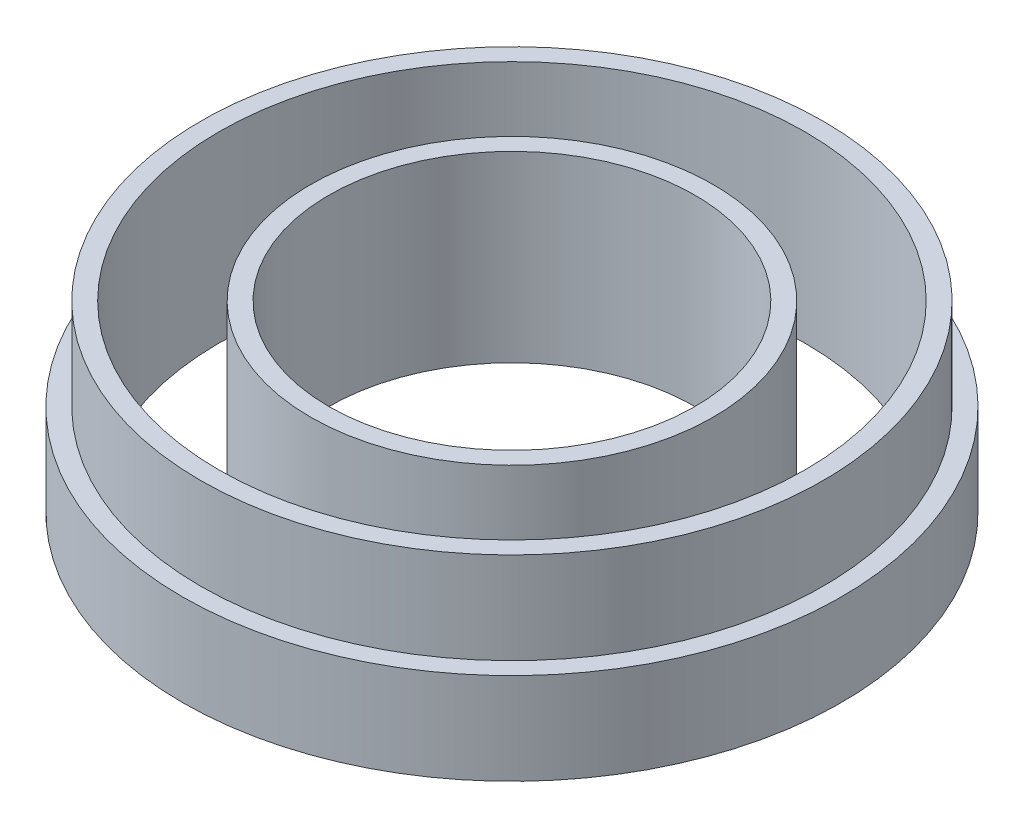
ISO-10303-21;
HEADER;
FILE_DESCRIPTION(('STEP AP214'),'2;1');
FILE_NAME('part.step','',(''),(''),'','','');
FILE_SCHEMA(('AUTOMOTIVE_DESIGN { 1 0 10303 214 1 1 1 1 }'));
ENDSEC;
DATA;
#1=APPLICATION_CONTEXT('core data for automotive mechanical design processes');
#2=APPLICATION_PROTOCOL_DEFINITION('international standard','automotive_design',2000,#1);
#3=PRODUCT_CONTEXT('',#1,'mechanical');
#4=PRODUCT('Part','Part','',(#3));
#5=PRODUCT_RELATED_PRODUCT_CATEGORY('part','',(#4));
#6=PRODUCT_DEFINITION_FORMATION('','',#4);
#7=PRODUCT_DEFINITION_CONTEXT('part definition',#1,'design');
#8=PRODUCT_DEFINITION('design','',#6,#7);
#9=PRODUCT_DEFINITION_SHAPE('','',#8);
#10=(LENGTH_UNIT() NAMED_UNIT(*) SI_UNIT(.MILLI.,.METRE.));
#11=(NAMED_UNIT(*) PLANE_ANGLE_UNIT() SI_UNIT($,.RADIAN.));
#12=(NAMED_UNIT(*) SI_UNIT($,.STERADIAN.) SOLID_ANGLE_UNIT());
#13=UNCERTAINTY_MEASURE_WITH_UNIT(LENGTH_MEASURE(1.E-05),#10,'distance_accuracy_value','');
#14=(GEOMETRIC_REPRESENTATION_CONTEXT(3) GLOBAL_UNCERTAINTY_ASSIGNED_CONTEXT((#13)) GLOBAL_UNIT_ASSIGNED_CONTEXT((#10,
#11,#12)) REPRESENTATION_CONTEXT('',''));
#15=CARTESIAN_POINT('',(0.,0.,0.));
#16=DIRECTION('',(0.,0.,1.));
#17=DIRECTION('',(1.,0.,0.));
#18=AXIS2_PLACEMENT_3D('',#15,#16,#17);
#19=CARTESIAN_POINT('',(0.,5.,0.));
#20=DIRECTION('',(0.,-1.,0.));
#21=DIRECTION('',(0.,0.,-1.));
#22=AXIS2_PLACEMENT_3D('',#19,#20,#21);
#23=CYLINDRICAL_SURFACE('',#22,8.);
#24=CARTESIAN_POINT('',(0.,5.,0.));
#25=DIRECTION('',(0.,1.,0.));
#26=DIRECTION('',(0.,0.,1.));
#27=AXIS2_PLACEMENT_3D('',#24,#25,#26);
#28=CIRCLE('',#27,8.);
#29=CARTESIAN_POINT('',(0.,5.,8.));
#30=VERTEX_POINT('',#29);
#31=EDGE_CURVE('E54',#30,#30,#28,.T.);
#32=ORIENTED_EDGE('',*,*,#31,.T.);
#33=EDGE_LOOP('',(#32));
#34=FACE_BOUND('',#33,.T.);
#35=CARTESIAN_POINT('',(0.,0.,0.));
#36=DIRECTION('',(0.,1.,0.));
#37=DIRECTION('',(0.,0.,1.));
#38=AXIS2_PLACEMENT_3D('',#35,#36,#37);
#39=CIRCLE('',#38,8.);
#40=CARTESIAN_POINT('',(0.,0.,8.));
#41=VERTEX_POINT('',#40);
#42=EDGE_CURVE('E50',#41,#41,#39,.T.);
#43=ORIENTED_EDGE('',*,*,#42,.F.);
#44=EDGE_LOOP('',(#43));
#45=FACE_BOUND('',#44,.T.);
#46=ADVANCED_FACE('F47',(#34,#45),#23,.F.);
#47=CARTESIAN_POINT('',(0.,5.,0.));
#48=DIRECTION('',(0.,-1.,0.));
#49=DIRECTION('',(0.,0.,-1.));
#50=AXIS2_PLACEMENT_3D('',#47,#48,#49);
#51=CYLINDRICAL_SURFACE('',#50,8.5);
#52=CARTESIAN_POINT('',(0.,2.5,0.));
#53=DIRECTION('',(0.,1.,0.));
#54=DIRECTION('',(0.,0.,1.));
#55=AXIS2_PLACEMENT_3D('',#52,#53,#54);
#56=CIRCLE('',#55,8.5);
#57=CARTESIAN_POINT('',(0.,2.5,8.5));
#58=VERTEX_POINT('',#57);
#59=EDGE_CURVE('E64',#58,#58,#56,.T.);
#60=ORIENTED_EDGE('',*,*,#59,.T.);
#61=EDGE_LOOP('',(#60));
#62=FACE_BOUND('',#61,.T.);
#63=CARTESIAN_POINT('',(0.,5.,0.));
#64=DIRECTION('',(0.,1.,0.));
#65=DIRECTION('',(0.,0.,1.));
#66=AXIS2_PLACEMENT_3D('',#63,#64,#65);
#67=CIRCLE('',#66,8.5);
#68=CARTESIAN_POINT('',(0.,5.,8.5));
#69=VERTEX_POINT('',#68);
#70=EDGE_CURVE('E12',#69,#69,#67,.T.);
#71=ORIENTED_EDGE('',*,*,#70,.F.);
#72=EDGE_LOOP('',(#71));
#73=FACE_BOUND('',#72,.T.);
#74=ADVANCED_FACE('F70',(#62,#73),#51,.T.);
#75=CARTESIAN_POINT('',(0.,5.,0.));
#76=DIRECTION('',(0.,1.,0.));
#77=DIRECTION('',(0.,0.,1.));
#78=AXIS2_PLACEMENT_3D('',#75,#76,#77);
#79=PLANE('',#78);
#80=ORIENTED_EDGE('',*,*,#31,.F.);
#81=EDGE_LOOP('',(#80));
#82=FACE_BOUND('',#81,.T.);
#83=ORIENTED_EDGE('',*,*,#70,.T.);
#84=EDGE_LOOP('',(#83));
#85=FACE_BOUND('',#84,.T.);
#86=ADVANCED_FACE('F85',(#82,#85),#79,.T.);
#87=CARTESIAN_POINT('',(0.,0.,0.));
#88=DIRECTION('',(0.,1.,0.));
#89=DIRECTION('',(0.,0.,1.));
#90=AXIS2_PLACEMENT_3D('',#87,#88,#89);
#91=PLANE('',#90);
#92=ORIENTED_EDGE('',*,*,#42,.T.);
#93=EDGE_LOOP('',(#92));
#94=FACE_BOUND('',#93,.T.);
#95=CARTESIAN_POINT('',(0.,0.,0.));
#96=DIRECTION('',(0.,1.,0.));
#97=DIRECTION('',(0.,0.,1.));
#98=AXIS2_PLACEMENT_3D('',#95,#96,#97);
#99=CIRCLE('',#98,9.);
#100=CARTESIAN_POINT('',(0.,0.,9.));
#101=VERTEX_POINT('',#100);
#102=EDGE_CURVE('E60',#101,#101,#99,.T.);
#103=ORIENTED_EDGE('',*,*,#102,.F.);
#104=EDGE_LOOP('',(#103));
#105=FACE_BOUND('',#104,.T.);
#106=ADVANCED_FACE('F76',(#94,#105),#91,.F.);
#107=CARTESIAN_POINT('',(0.,2.5,0.));
#108=DIRECTION('',(0.,1.,0.));
#109=DIRECTION('',(0.,0.,1.));
#110=AXIS2_PLACEMENT_3D('',#107,#108,#109);
#111=PLANE('',#110);
#112=CARTESIAN_POINT('',(0.,2.5,0.));
#113=DIRECTION('',(0.,1.,0.));
#114=DIRECTION('',(0.,0.,1.));
#115=AXIS2_PLACEMENT_3D('',#112,#113,#114);
#116=CIRCLE('',#115,9.);
#117=CARTESIAN_POINT('',(0.,2.5,9.));
#118=VERTEX_POINT('',#117);
#119=EDGE_CURVE('E63',#118,#118,#116,.T.);
#120=ORIENTED_EDGE('',*,*,#119,.T.);
#121=EDGE_LOOP('',(#120));
#122=FACE_BOUND('',#121,.T.);
#123=ORIENTED_EDGE('',*,*,#59,.F.);
#124=EDGE_LOOP('',(#123));
#125=FACE_BOUND('',#124,.T.);
#126=ADVANCED_FACE('F73',(#122,#125),#111,.T.);
#127=CARTESIAN_POINT('',(0.,2.5,0.));
#128=DIRECTION('',(0.,-1.,0.));
#129=DIRECTION('',(0.,0.,-1.));
#130=AXIS2_PLACEMENT_3D('',#127,#128,#129);
#131=CYLINDRICAL_SURFACE('',#130,9.);
#132=ORIENTED_EDGE('',*,*,#119,.F.);
#133=EDGE_LOOP('',(#132));
#134=FACE_BOUND('',#133,.T.);
#135=ORIENTED_EDGE('',*,*,#102,.T.);
#136=EDGE_LOOP('',(#135));
#137=FACE_BOUND('',#136,.T.);
#138=ADVANCED_FACE('F75',(#134,#137),#131,.T.);
#139=CLOSED_SHELL('',(#46,#74,#86,#106,#126,#138));
#140=MANIFOLD_SOLID_BREP('B2',#139);
#141=CARTESIAN_POINT('',(0.,5.,0.));
#142=DIRECTION('',(0.,-1.,0.));
#143=DIRECTION('',(0.,0.,-1.));
#144=AXIS2_PLACEMENT_3D('',#141,#142,#143);
#145=CYLINDRICAL_SURFACE('',#144,5.);
#146=CARTESIAN_POINT('',(0.,5.,0.));
#147=DIRECTION('',(0.,1.,0.));
#148=DIRECTION('',(0.,0.,1.));
#149=AXIS2_PLACEMENT_3D('',#146,#147,#148);
#150=CIRCLE('',#149,5.);
#151=CARTESIAN_POINT('',(0.,5.,5.));
#152=VERTEX_POINT('',#151);
#153=EDGE_CURVE('E149',#152,#152,#150,.T.);
#154=ORIENTED_EDGE('',*,*,#153,.T.);
#155=EDGE_LOOP('',(#154));
#156=FACE_BOUND('',#155,.T.);
#157=CARTESIAN_POINT('',(0.,0.,0.));
#158=DIRECTION('',(0.,1.,0.));
#159=DIRECTION('',(0.,0.,1.));
#160=AXIS2_PLACEMENT_3D('',#157,#158,#159);
#161=CIRCLE('',#160,5.);
#162=CARTESIAN_POINT('',(0.,0.,5.));
#163=VERTEX_POINT('',#162);
#164=EDGE_CURVE('E155',#163,#163,#161,.T.);
#165=ORIENTED_EDGE('',*,*,#164,.F.);
#166=EDGE_LOOP('',(#165));
#167=FACE_BOUND('',#166,.T.);
#168=ADVANCED_FACE('F142',(#156,#167),#145,.F.);
#169=CARTESIAN_POINT('',(0.,5.,0.));
#170=DIRECTION('',(0.,-1.,0.));
#171=DIRECTION('',(0.,0.,-1.));
#172=AXIS2_PLACEMENT_3D('',#169,#170,#171);
#173=CYLINDRICAL_SURFACE('',#172,5.5);
#174=CARTESIAN_POINT('',(0.,5.,0.));
#175=DIRECTION('',(0.,1.,0.));
#176=DIRECTION('',(0.,0.,1.));
#177=AXIS2_PLACEMENT_3D('',#174,#175,#176);
#178=CIRCLE('',#177,5.5);
#179=CARTESIAN_POINT('',(0.,5.,5.5));
#180=VERTEX_POINT('',#179);
#181=EDGE_CURVE('E46',#180,#180,#178,.T.);
#182=ORIENTED_EDGE('',*,*,#181,.F.);
#183=EDGE_LOOP('',(#182));
#184=FACE_BOUND('',#183,.T.);
#185=CARTESIAN_POINT('',(0.,0.,0.));
#186=DIRECTION('',(0.,1.,0.));
#187=DIRECTION('',(0.,0.,1.));
#188=AXIS2_PLACEMENT_3D('',#185,#186,#187);
#189=CIRCLE('',#188,5.5);
#190=CARTESIAN_POINT('',(0.,0.,5.5));
#191=VERTEX_POINT('',#190);
#192=EDGE_CURVE('E145',#191,#191,#189,.T.);
#193=ORIENTED_EDGE('',*,*,#192,.T.);
#194=EDGE_LOOP('',(#193));
#195=FACE_BOUND('',#194,.T.);
#196=ADVANCED_FACE('F162',(#184,#195),#173,.T.);
#197=CARTESIAN_POINT('',(0.,5.,0.));
#198=DIRECTION('',(0.,1.,0.));
#199=DIRECTION('',(0.,0.,1.));
#200=AXIS2_PLACEMENT_3D('',#197,#198,#199);
#201=PLANE('',#200);
#202=ORIENTED_EDGE('',*,*,#153,.F.);
#203=EDGE_LOOP('',(#202));
#204=FACE_BOUND('',#203,.T.);
#205=ORIENTED_EDGE('',*,*,#181,.T.);
#206=EDGE_LOOP('',(#205));
#207=FACE_BOUND('',#206,.T.);
#208=ADVANCED_FACE('F166',(#204,#207),#201,.T.);
#209=CARTESIAN_POINT('',(0.,0.,0.));
#210=DIRECTION('',(0.,1.,0.));
#211=DIRECTION('',(0.,0.,1.));
#212=AXIS2_PLACEMENT_3D('',#209,#210,#211);
#213=PLANE('',#212);
#214=ORIENTED_EDGE('',*,*,#164,.T.);
#215=EDGE_LOOP('',(#214));
#216=FACE_BOUND('',#215,.T.);
#217=ORIENTED_EDGE('',*,*,#192,.F.);
#218=EDGE_LOOP('',(#217));
#219=FACE_BOUND('',#218,.T.);
#220=ADVANCED_FACE('F164',(#216,#219),#213,.F.);
#221=CLOSED_SHELL('',(#168,#196,#208,#220));
#222=MANIFOLD_SOLID_BREP('B7',#221);
#223=ADVANCED_BREP_SHAPE_REPRESENTATION('',(#18,#140,#222),#14);
#224=SHAPE_DEFINITION_REPRESENTATION(#9,#223);
ENDSEC;
END-ISO-10303-21;
